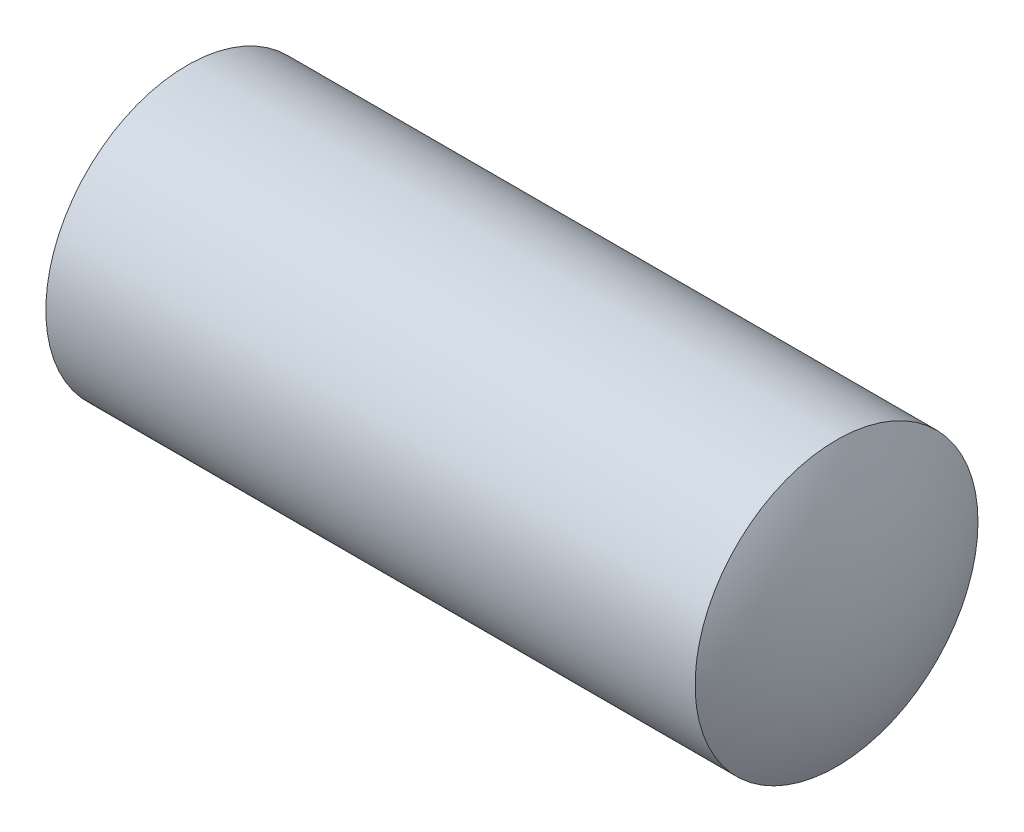
ISO-10303-21;
HEADER;
FILE_DESCRIPTION(('STEP AP214'),'2;1');
FILE_NAME('part.step','',(''),(''),'','','');
FILE_SCHEMA(('AUTOMOTIVE_DESIGN { 1 0 10303 214 1 1 1 1 }'));
ENDSEC;
DATA;
#1=APPLICATION_CONTEXT('core data for automotive mechanical design processes');
#2=APPLICATION_PROTOCOL_DEFINITION('international standard','automotive_design',2000,#1);
#3=PRODUCT_CONTEXT('',#1,'mechanical');
#4=PRODUCT('Part','Part','',(#3));
#5=PRODUCT_RELATED_PRODUCT_CATEGORY('part','',(#4));
#6=PRODUCT_DEFINITION_FORMATION('','',#4);
#7=PRODUCT_DEFINITION_CONTEXT('part definition',#1,'design');
#8=PRODUCT_DEFINITION('design','',#6,#7);
#9=PRODUCT_DEFINITION_SHAPE('','',#8);
#10=(LENGTH_UNIT() NAMED_UNIT(*) SI_UNIT(.MILLI.,.METRE.));
#11=(NAMED_UNIT(*) PLANE_ANGLE_UNIT() SI_UNIT($,.RADIAN.));
#12=(NAMED_UNIT(*) SI_UNIT($,.STERADIAN.) SOLID_ANGLE_UNIT());
#13=UNCERTAINTY_MEASURE_WITH_UNIT(LENGTH_MEASURE(1.E-05),#10,'distance_accuracy_value','');
#14=(GEOMETRIC_REPRESENTATION_CONTEXT(3) GLOBAL_UNCERTAINTY_ASSIGNED_CONTEXT((#13)) GLOBAL_UNIT_ASSIGNED_CONTEXT((#10,
#11,#12)) REPRESENTATION_CONTEXT('',''));
#15=CARTESIAN_POINT('',(0.,0.,0.));
#16=DIRECTION('',(0.,0.,1.));
#17=DIRECTION('',(1.,0.,0.));
#18=AXIS2_PLACEMENT_3D('',#15,#16,#17);
#19=CARTESIAN_POINT('',(22.3129489954519,0.00296485633077826,0.6));
#20=DIRECTION('',(0.000132876040065233,-0.999999991171979,0.));
#21=DIRECTION('',(0.999999991171979,0.000132876040065955,0.));
#22=AXIS2_PLACEMENT_3D('',#19,#20,#21);
#23=SPHERICAL_SURFACE('',#22,2.);
#24=CARTESIAN_POINT('',(22.3129489954519,0.00296485633077826,0.6));
#25=DIRECTION('',(-0.999999991171979,-0.000132876040065955,0.));
#26=DIRECTION('',(0.,0.,-1.));
#27=AXIS2_PLACEMENT_3D('',#24,#25,#26);
#28=SPHERICAL_SURFACE('',#27,2.);
#29=CARTESIAN_POINT('',(24.0449997877303,0.00319500438339393,0.6));
#30=DIRECTION('',(-0.999999991171979,-0.000132876040065955,0.));
#31=DIRECTION('',(0.,0.,-1.));
#32=AXIS2_PLACEMENT_3D('',#29,#30,#31);
#33=CIRCLE('',#32,1.);
#34=CARTESIAN_POINT('',(24.0449997877303,0.00319500438339393,-0.4));
#35=VERTEX_POINT('',#34);
#36=EDGE_CURVE('E11',#35,#35,#33,.T.);
#37=ORIENTED_EDGE('',*,*,#36,.F.);
#38=EDGE_LOOP('',(#37));
#39=FACE_BOUND('',#38,.T.);
#40=ADVANCED_FACE('F17',(#39),#28,.T.);
#41=CARTESIAN_POINT('',(21.1870506205292,0.00281525141199168,0.6));
#42=DIRECTION('',(0.000132876040065233,-0.999999991171979,0.));
#43=DIRECTION('',(-0.999999991171979,-0.000132876040065233,0.));
#44=AXIS2_PLACEMENT_3D('',#41,#42,#43);
#45=SPHERICAL_SURFACE('',#44,2.);
#46=CARTESIAN_POINT('',(21.1870506205292,0.00281525141199168,0.6));
#47=DIRECTION('',(-0.999999991171979,-0.000132876040065955,0.));
#48=DIRECTION('',(0.,0.,-1.));
#49=AXIS2_PLACEMENT_3D('',#46,#47,#48);
#50=SPHERICAL_SURFACE('',#49,2.);
#51=CARTESIAN_POINT('',(19.4549998282509,0.00258510335948703,0.6));
#52=DIRECTION('',(-0.999999991171979,-0.000132876040065955,0.));
#53=DIRECTION('',(0.,0.,-1.));
#54=AXIS2_PLACEMENT_3D('',#51,#52,#53);
#55=CIRCLE('',#54,1.);
#56=CARTESIAN_POINT('',(19.4549998282509,0.00258510335948703,-0.4));
#57=VERTEX_POINT('',#56);
#58=EDGE_CURVE('E27',#57,#57,#55,.T.);
#59=ORIENTED_EDGE('',*,*,#58,.T.);
#60=EDGE_LOOP('',(#59));
#61=FACE_BOUND('',#60,.T.);
#62=ADVANCED_FACE('F40',(#61),#50,.T.);
#63=CARTESIAN_POINT('',(20.6024998181207,0.00273757861535273,0.6));
#64=DIRECTION('',(-0.999999991171979,-0.000132876040065955,0.));
#65=DIRECTION('',(0.,0.,-1.));
#66=AXIS2_PLACEMENT_3D('',#63,#64,#65);
#67=CYLINDRICAL_SURFACE('',#66,1.);
#68=ORIENTED_EDGE('',*,*,#36,.T.);
#69=EDGE_LOOP('',(#68));
#70=FACE_BOUND('',#69,.T.);
#71=ORIENTED_EDGE('',*,*,#58,.F.);
#72=EDGE_LOOP('',(#71));
#73=FACE_BOUND('',#72,.T.);
#74=ADVANCED_FACE('F19',(#70,#73),#67,.T.);
#75=CLOSED_SHELL('',(#40,#62,#74));
#76=MANIFOLD_SOLID_BREP('B1',#75);
#77=ADVANCED_BREP_SHAPE_REPRESENTATION('',(#18,#76),#14);
#78=SHAPE_DEFINITION_REPRESENTATION(#9,#77);
ENDSEC;
END-ISO-10303-21;
